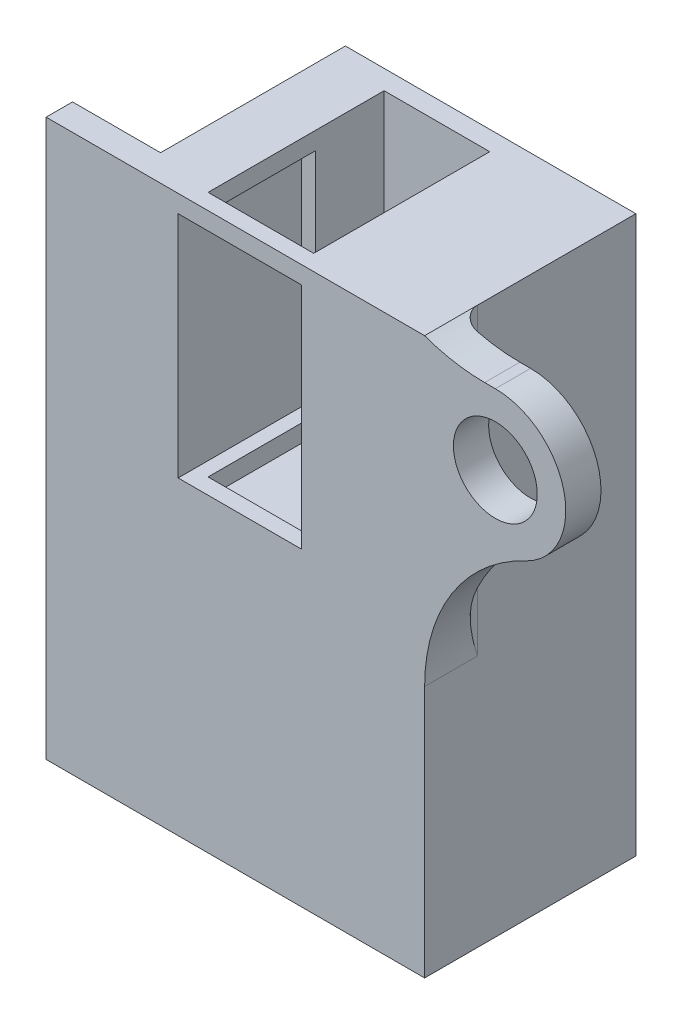
ISO-10303-21;
HEADER;
FILE_DESCRIPTION(('STEP AP214'),'2;1');
FILE_NAME('part.step','',(''),(''),'','','');
FILE_SCHEMA(('AUTOMOTIVE_DESIGN { 1 0 10303 214 1 1 1 1 }'));
ENDSEC;
DATA;
#1=APPLICATION_CONTEXT('core data for automotive mechanical design processes');
#2=APPLICATION_PROTOCOL_DEFINITION('international standard','automotive_design',2000,#1);
#3=PRODUCT_CONTEXT('',#1,'mechanical');
#4=PRODUCT('Part','Part','',(#3));
#5=PRODUCT_RELATED_PRODUCT_CATEGORY('part','',(#4));
#6=PRODUCT_DEFINITION_FORMATION('','',#4);
#7=PRODUCT_DEFINITION_CONTEXT('part definition',#1,'design');
#8=PRODUCT_DEFINITION('design','',#6,#7);
#9=PRODUCT_DEFINITION_SHAPE('','',#8);
#10=(LENGTH_UNIT() NAMED_UNIT(*) SI_UNIT(.MILLI.,.METRE.));
#11=(NAMED_UNIT(*) PLANE_ANGLE_UNIT() SI_UNIT($,.RADIAN.));
#12=(NAMED_UNIT(*) SI_UNIT($,.STERADIAN.) SOLID_ANGLE_UNIT());
#13=UNCERTAINTY_MEASURE_WITH_UNIT(LENGTH_MEASURE(1.E-05),#10,'distance_accuracy_value','');
#14=(GEOMETRIC_REPRESENTATION_CONTEXT(3) GLOBAL_UNCERTAINTY_ASSIGNED_CONTEXT((#13)) GLOBAL_UNIT_ASSIGNED_CONTEXT((#10,
#11,#12)) REPRESENTATION_CONTEXT('',''));
#15=CARTESIAN_POINT('',(0.,0.,0.));
#16=DIRECTION('',(0.,0.,1.));
#17=DIRECTION('',(1.,0.,0.));
#18=AXIS2_PLACEMENT_3D('',#15,#16,#17);
#19=CARTESIAN_POINT('',(0.,0.,-7.));
#20=DIRECTION('',(0.,0.,1.));
#21=DIRECTION('',(1.,0.,0.));
#22=AXIS2_PLACEMENT_3D('',#19,#20,#21);
#23=PLANE('',#22);
#24=DIRECTION('',(0.,-1.,0.));
#25=VECTOR('',#24,1.);
#26=CARTESIAN_POINT('',(3.3,0.,-7.));
#27=LINE('',#26,#25);
#28=CARTESIAN_POINT('',(3.3,32.6,-7.));
#29=VERTEX_POINT('',#28);
#30=CARTESIAN_POINT('',(3.3,19.6,-7.));
#31=VERTEX_POINT('',#30);
#32=EDGE_CURVE('E279',#29,#31,#27,.T.);
#33=ORIENTED_EDGE('',*,*,#32,.F.);
#34=DIRECTION('',(-1.,0.,0.));
#35=VECTOR('',#34,1.);
#36=CARTESIAN_POINT('',(0.,32.6,-7.));
#37=LINE('',#36,#35);
#38=CARTESIAN_POINT('',(2.5,32.6,-7.));
#39=VERTEX_POINT('',#38);
#40=EDGE_CURVE('E345',#29,#39,#37,.T.);
#41=ORIENTED_EDGE('',*,*,#40,.T.);
#42=DIRECTION('',(0.,-1.,0.));
#43=VECTOR('',#42,1.);
#44=CARTESIAN_POINT('',(2.50000000000001,0.,-7.));
#45=LINE('',#44,#43);
#46=CARTESIAN_POINT('',(2.5,19.6,-7.));
#47=VERTEX_POINT('',#46);
#48=EDGE_CURVE('E351',#39,#47,#45,.T.);
#49=ORIENTED_EDGE('',*,*,#48,.T.);
#50=DIRECTION('',(1.,0.,0.));
#51=VECTOR('',#50,1.);
#52=CARTESIAN_POINT('',(0.,19.6,-7.));
#53=LINE('',#52,#51);
#54=EDGE_CURVE('E356',#47,#31,#53,.T.);
#55=ORIENTED_EDGE('',*,*,#54,.T.);
#56=EDGE_LOOP('',(#33,#41,#49,#55));
#57=FACE_BOUND('',#56,.T.);
#58=ADVANCED_FACE('F43',(#57),#23,.T.);
#59=CARTESIAN_POINT('',(0.,0.,0.));
#60=DIRECTION('',(1.,0.,0.));
#61=DIRECTION('',(0.,0.,-1.));
#62=AXIS2_PLACEMENT_3D('',#59,#60,#61);
#63=PLANE('',#62);
#64=DIRECTION('',(0.,0.,1.));
#65=VECTOR('',#64,1.);
#66=CARTESIAN_POINT('',(0.,33.6,-12.));
#67=LINE('',#66,#65);
#68=CARTESIAN_POINT('',(0.,33.6,-12.));
#69=VERTEX_POINT('',#68);
#70=CARTESIAN_POINT('',(0.,33.6,-1.5));
#71=VERTEX_POINT('',#70);
#72=EDGE_CURVE('E304',#69,#71,#67,.T.);
#73=ORIENTED_EDGE('',*,*,#72,.F.);
#74=DIRECTION('',(0.,1.,0.));
#75=VECTOR('',#74,1.);
#76=CARTESIAN_POINT('',(0.,2.,-12.));
#77=LINE('',#76,#75);
#78=CARTESIAN_POINT('',(0.,2.,-12.));
#79=VERTEX_POINT('',#78);
#80=EDGE_CURVE('E288',#79,#69,#77,.T.);
#81=ORIENTED_EDGE('',*,*,#80,.F.);
#82=DIRECTION('',(0.,0.,1.));
#83=VECTOR('',#82,1.);
#84=CARTESIAN_POINT('',(0.,2.,-12.));
#85=LINE('',#84,#83);
#86=CARTESIAN_POINT('',(0.,2.,-1.5));
#87=VERTEX_POINT('',#86);
#88=EDGE_CURVE('E422',#79,#87,#85,.T.);
#89=ORIENTED_EDGE('',*,*,#88,.T.);
#90=DIRECTION('',(0.,-1.,0.));
#91=VECTOR('',#90,1.);
#92=CARTESIAN_POINT('',(0.,37.1,-1.5));
#93=LINE('',#92,#91);
#94=EDGE_CURVE('E321',#71,#87,#93,.T.);
#95=ORIENTED_EDGE('',*,*,#94,.F.);
#96=EDGE_LOOP('',(#73,#81,#89,#95));
#97=FACE_BOUND('',#96,.T.);
#98=ADVANCED_FACE('F492',(#97),#63,.F.);
#99=CARTESIAN_POINT('',(16.5,0.,0.));
#100=DIRECTION('',(0.,0.,-1.));
#101=DIRECTION('',(-1.,0.,0.));
#102=AXIS2_PLACEMENT_3D('',#99,#100,#101);
#103=PLANE('',#102);
#104=DIRECTION('',(-1.,0.,0.));
#105=VECTOR('',#104,1.);
#106=CARTESIAN_POINT('',(0.,32.6,0.));
#107=LINE('',#106,#105);
#108=CARTESIAN_POINT('',(9.5,32.6,0.));
#109=VERTEX_POINT('',#108);
#110=CARTESIAN_POINT('',(2.5,32.6,0.));
#111=VERTEX_POINT('',#110);
#112=EDGE_CURVE('E363',#109,#111,#107,.T.);
#113=ORIENTED_EDGE('',*,*,#112,.F.);
#114=DIRECTION('',(0.,1.,0.));
#115=VECTOR('',#114,1.);
#116=CARTESIAN_POINT('',(9.5,0.,0.));
#117=LINE('',#116,#115);
#118=CARTESIAN_POINT('',(9.5,19.6,0.));
#119=VERTEX_POINT('',#118);
#120=EDGE_CURVE('E340',#119,#109,#117,.T.);
#121=ORIENTED_EDGE('',*,*,#120,.F.);
#122=DIRECTION('',(1.,0.,0.));
#123=VECTOR('',#122,1.);
#124=CARTESIAN_POINT('',(0.,19.6,0.));
#125=LINE('',#124,#123);
#126=CARTESIAN_POINT('',(2.5,19.6,0.));
#127=VERTEX_POINT('',#126);
#128=EDGE_CURVE('E346',#127,#119,#125,.T.);
#129=ORIENTED_EDGE('',*,*,#128,.F.);
#130=DIRECTION('',(0.,-1.,0.));
#131=VECTOR('',#130,1.);
#132=CARTESIAN_POINT('',(2.50000000000001,0.,0.));
#133=LINE('',#132,#131);
#134=EDGE_CURVE('E367',#111,#127,#133,.T.);
#135=ORIENTED_EDGE('',*,*,#134,.F.);
#136=EDGE_LOOP('',(#113,#121,#129,#135));
#137=FACE_BOUND('',#136,.T.);
#138=CARTESIAN_POINT('',(20.5182193377738,29.,0.));
#139=DIRECTION('',(0.,0.,-1.));
#140=DIRECTION('',(-1.,0.,0.));
#141=AXIS2_PLACEMENT_3D('',#138,#139,#140);
#142=CIRCLE('',#141,2.38125);
#143=CARTESIAN_POINT('',(18.1369693377738,29.,0.));
#144=VERTEX_POINT('',#143);
#145=EDGE_CURVE('E398',#144,#144,#142,.T.);
#146=ORIENTED_EDGE('',*,*,#145,.T.);
#147=EDGE_LOOP('',(#146));
#148=FACE_BOUND('',#147,.T.);
#149=DIRECTION('',(-1.,0.,0.));
#150=VECTOR('',#149,1.);
#151=CARTESIAN_POINT('',(0.,33.,0.));
#152=LINE('',#151,#150);
#153=CARTESIAN_POINT('',(20.5182193377738,33.,0.));
#154=VERTEX_POINT('',#153);
#155=CARTESIAN_POINT('',(19.9117444218464,33.,0.));
#156=VERTEX_POINT('',#155);
#157=EDGE_CURVE('E408',#154,#156,#152,.T.);
#158=ORIENTED_EDGE('',*,*,#157,.T.);
#159=CARTESIAN_POINT('',(19.9117444218464,43.,0.));
#160=DIRECTION('',(0.,0.,-1.));
#161=DIRECTION('',(-1.,0.,0.));
#162=AXIS2_PLACEMENT_3D('',#159,#160,#161);
#163=CIRCLE('',#162,10.);
#164=CARTESIAN_POINT('',(16.5,33.6,0.));
#165=VERTEX_POINT('',#164);
#166=EDGE_CURVE('E439',#156,#165,#163,.T.);
#167=ORIENTED_EDGE('',*,*,#166,.T.);
#168=DIRECTION('',(1.,0.,0.));
#169=VECTOR('',#168,1.);
#170=CARTESIAN_POINT('',(-5.,33.6,0.));
#171=LINE('',#170,#169);
#172=CARTESIAN_POINT('',(-5.,33.6,0.));
#173=VERTEX_POINT('',#172);
#174=EDGE_CURVE('E313',#173,#165,#171,.T.);
#175=ORIENTED_EDGE('',*,*,#174,.F.);
#176=DIRECTION('',(0.,1.,0.));
#177=VECTOR('',#176,1.);
#178=CARTESIAN_POINT('',(-5.,2.,0.));
#179=LINE('',#178,#177);
#180=CARTESIAN_POINT('',(-5.,2.,0.));
#181=VERTEX_POINT('',#180);
#182=EDGE_CURVE('E322',#181,#173,#179,.T.);
#183=ORIENTED_EDGE('',*,*,#182,.F.);
#184=DIRECTION('',(1.,0.,0.));
#185=VECTOR('',#184,1.);
#186=CARTESIAN_POINT('',(0.,2.,0.));
#187=LINE('',#186,#185);
#188=CARTESIAN_POINT('',(16.5,2.,0.));
#189=VERTEX_POINT('',#188);
#190=EDGE_CURVE('E425',#181,#189,#187,.T.);
#191=ORIENTED_EDGE('',*,*,#190,.T.);
#192=DIRECTION('',(0.,-1.,0.));
#193=VECTOR('',#192,1.);
#194=CARTESIAN_POINT('',(16.5,0.,0.));
#195=LINE('',#194,#193);
#196=CARTESIAN_POINT('',(16.5,16.342263231169,0.));
#197=VERTEX_POINT('',#196);
#198=EDGE_CURVE('E431',#197,#189,#195,.T.);
#199=ORIENTED_EDGE('',*,*,#198,.F.);
#200=CARTESIAN_POINT('',(26.5,16.342263231169,0.));
#201=DIRECTION('',(0.,0.,-1.));
#202=DIRECTION('',(-1.,0.,0.));
#203=AXIS2_PLACEMENT_3D('',#200,#201,#202);
#204=CIRCLE('',#203,10.);
#205=CARTESIAN_POINT('',(22.2272995269813,25.383503780334,0.));
#206=VERTEX_POINT('',#205);
#207=EDGE_CURVE('E452',#197,#206,#204,.T.);
#208=ORIENTED_EDGE('',*,*,#207,.T.);
#209=CARTESIAN_POINT('',(20.5182193377738,29.,0.));
#210=DIRECTION('',(0.,0.,1.));
#211=DIRECTION('',(1.,0.,0.));
#212=AXIS2_PLACEMENT_3D('',#209,#210,#211);
#213=CIRCLE('',#212,4.);
#214=EDGE_CURVE('E402',#154,#206,#213,.F.);
#215=ORIENTED_EDGE('',*,*,#214,.F.);
#216=EDGE_LOOP('',(#158,#167,#175,#183,#191,#199,#208,#215));
#217=FACE_BOUND('',#216,.T.);
#218=ADVANCED_FACE('F480',(#137,#148,#217),#103,.F.);
#219=CARTESIAN_POINT('',(16.5,0.,0.));
#220=DIRECTION('',(1.,0.,0.));
#221=DIRECTION('',(0.,0.,-1.));
#222=AXIS2_PLACEMENT_3D('',#219,#220,#221);
#223=PLANE('',#222);
#224=DIRECTION('',(0.,0.,1.));
#225=VECTOR('',#224,1.);
#226=CARTESIAN_POINT('',(16.5,2.,-12.));
#227=LINE('',#226,#225);
#228=CARTESIAN_POINT('',(16.5,2.,-12.));
#229=VERTEX_POINT('',#228);
#230=EDGE_CURVE('E421',#229,#189,#227,.T.);
#231=ORIENTED_EDGE('',*,*,#230,.F.);
#232=DIRECTION('',(0.,-1.,0.));
#233=VECTOR('',#232,1.);
#234=CARTESIAN_POINT('',(16.5,2.,-12.));
#235=LINE('',#234,#233);
#236=CARTESIAN_POINT('',(16.5,33.6,-12.));
#237=VERTEX_POINT('',#236);
#238=EDGE_CURVE('E296',#237,#229,#235,.T.);
#239=ORIENTED_EDGE('',*,*,#238,.F.);
#240=DIRECTION('',(0.,0.,-1.));
#241=VECTOR('',#240,1.);
#242=CARTESIAN_POINT('',(16.5,33.6,0.));
#243=LINE('',#242,#241);
#244=CARTESIAN_POINT('',(16.5,33.6,-3.));
#245=VERTEX_POINT('',#244);
#246=EDGE_CURVE('E317',#245,#237,#243,.T.);
#247=ORIENTED_EDGE('',*,*,#246,.F.);
#248=DIRECTION('',(0.,1.,0.));
#249=VECTOR('',#248,1.);
#250=CARTESIAN_POINT('',(16.5,0.,-3.));
#251=LINE('',#250,#249);
#252=CARTESIAN_POINT('',(16.5,16.342263231169,-3.));
#253=VERTEX_POINT('',#252);
#254=EDGE_CURVE('E463',#245,#253,#251,.F.);
#255=ORIENTED_EDGE('',*,*,#254,.T.);
#256=DIRECTION('',(0.,0.,1.));
#257=VECTOR('',#256,1.);
#258=CARTESIAN_POINT('',(16.5,16.342263231169,0.));
#259=LINE('',#258,#257);
#260=EDGE_CURVE('E445',#253,#197,#259,.T.);
#261=ORIENTED_EDGE('',*,*,#260,.T.);
#262=ORIENTED_EDGE('',*,*,#198,.T.);
#263=EDGE_LOOP('',(#231,#239,#247,#255,#261,#262));
#264=FACE_BOUND('',#263,.T.);
#265=ADVANCED_FACE('F588',(#264),#223,.T.);
#266=CARTESIAN_POINT('',(0.,2.,-12.));
#267=DIRECTION('',(0.,1.,0.));
#268=DIRECTION('',(0.,0.,1.));
#269=AXIS2_PLACEMENT_3D('',#266,#267,#268);
#270=PLANE('',#269);
#271=CARTESIAN_POINT('',(8.25,2.,-6.));
#272=DIRECTION('',(0.,-1.,0.));
#273=DIRECTION('',(0.,0.,-1.));
#274=AXIS2_PLACEMENT_3D('',#271,#272,#273);
#275=CIRCLE('',#274,2.38125);
#276=CARTESIAN_POINT('',(8.25,2.,-8.38125));
#277=VERTEX_POINT('',#276);
#278=EDGE_CURVE('E377',#277,#277,#275,.T.);
#279=ORIENTED_EDGE('',*,*,#278,.F.);
#280=EDGE_LOOP('',(#279));
#281=FACE_BOUND('',#280,.T.);
#282=ORIENTED_EDGE('',*,*,#88,.F.);
#283=DIRECTION('',(-1.,0.,0.));
#284=VECTOR('',#283,1.);
#285=CARTESIAN_POINT('',(0.,2.,-12.));
#286=LINE('',#285,#284);
#287=EDGE_CURVE('E300',#229,#79,#286,.T.);
#288=ORIENTED_EDGE('',*,*,#287,.F.);
#289=ORIENTED_EDGE('',*,*,#230,.T.);
#290=ORIENTED_EDGE('',*,*,#190,.F.);
#291=DIRECTION('',(0.,0.,1.));
#292=VECTOR('',#291,1.);
#293=CARTESIAN_POINT('',(-5.,2.,-1.5));
#294=LINE('',#293,#292);
#295=CARTESIAN_POINT('',(-5.,2.,-1.5));
#296=VERTEX_POINT('',#295);
#297=EDGE_CURVE('E329',#296,#181,#294,.T.);
#298=ORIENTED_EDGE('',*,*,#297,.F.);
#299=DIRECTION('',(1.,0.,0.));
#300=VECTOR('',#299,1.);
#301=CARTESIAN_POINT('',(-5.,2.,-1.5));
#302=LINE('',#301,#300);
#303=EDGE_CURVE('E333',#296,#87,#302,.T.);
#304=ORIENTED_EDGE('',*,*,#303,.T.);
#305=EDGE_LOOP('',(#282,#288,#289,#290,#298,#304));
#306=FACE_BOUND('',#305,.T.);
#307=ADVANCED_FACE('F577',(#281,#306),#270,.F.);
#308=CARTESIAN_POINT('',(20.5182193377738,29.,-2.));
#309=DIRECTION('',(0.,0.,1.));
#310=DIRECTION('',(1.,0.,0.));
#311=AXIS2_PLACEMENT_3D('',#308,#309,#310);
#312=CYLINDRICAL_SURFACE('',#311,4.);
#313=ORIENTED_EDGE('',*,*,#214,.T.);
#314=DIRECTION('',(0.,0.,1.));
#315=VECTOR('',#314,1.);
#316=CARTESIAN_POINT('',(22.2272995269813,25.383503780334,-2.));
#317=LINE('',#316,#315);
#318=CARTESIAN_POINT('',(22.2272995269813,25.383503780334,-2.));
#319=VERTEX_POINT('',#318);
#320=EDGE_CURVE('E449',#206,#319,#317,.F.);
#321=ORIENTED_EDGE('',*,*,#320,.T.);
#322=CARTESIAN_POINT('',(20.5182193377738,29.,-2.));
#323=DIRECTION('',(0.,0.,1.));
#324=DIRECTION('',(1.,0.,0.));
#325=AXIS2_PLACEMENT_3D('',#322,#323,#324);
#326=CIRCLE('',#325,4.);
#327=CARTESIAN_POINT('',(20.5182193377738,33.,-2.));
#328=VERTEX_POINT('',#327);
#329=EDGE_CURVE('E403',#328,#319,#326,.F.);
#330=ORIENTED_EDGE('',*,*,#329,.F.);
#331=DIRECTION('',(0.,0.,1.));
#332=VECTOR('',#331,1.);
#333=CARTESIAN_POINT('',(20.5182193377738,33.,-2.));
#334=LINE('',#333,#332);
#335=EDGE_CURVE('E412',#328,#154,#334,.T.);
#336=ORIENTED_EDGE('',*,*,#335,.T.);
#337=EDGE_LOOP('',(#313,#321,#330,#336));
#338=FACE_BOUND('',#337,.T.);
#339=ADVANCED_FACE('F597',(#338),#312,.T.);
#340=CARTESIAN_POINT('',(0.,33.,-2.));
#341=DIRECTION('',(0.,1.,0.));
#342=DIRECTION('',(0.,0.,1.));
#343=AXIS2_PLACEMENT_3D('',#340,#341,#342);
#344=PLANE('',#343);
#345=DIRECTION('',(-1.,0.,0.));
#346=VECTOR('',#345,1.);
#347=CARTESIAN_POINT('',(0.,33.,-2.));
#348=LINE('',#347,#346);
#349=CARTESIAN_POINT('',(19.9117444218464,33.,-2.));
#350=VERTEX_POINT('',#349);
#351=EDGE_CURVE('E407',#328,#350,#348,.T.);
#352=ORIENTED_EDGE('',*,*,#351,.T.);
#353=DIRECTION('',(0.,0.,1.));
#354=VECTOR('',#353,1.);
#355=CARTESIAN_POINT('',(19.9117444218464,33.,0.));
#356=LINE('',#355,#354);
#357=EDGE_CURVE('E435',#350,#156,#356,.T.);
#358=ORIENTED_EDGE('',*,*,#357,.T.);
#359=ORIENTED_EDGE('',*,*,#157,.F.);
#360=ORIENTED_EDGE('',*,*,#335,.F.);
#361=EDGE_LOOP('',(#352,#358,#359,#360));
#362=FACE_BOUND('',#361,.T.);
#363=ADVANCED_FACE('F603',(#362),#344,.T.);
#364=CARTESIAN_POINT('',(0.,0.,-2.));
#365=DIRECTION('',(0.,0.,1.));
#366=DIRECTION('',(1.,0.,0.));
#367=AXIS2_PLACEMENT_3D('',#364,#365,#366);
#368=PLANE('',#367);
#369=CARTESIAN_POINT('',(20.5182193377738,29.,-2.));
#370=DIRECTION('',(0.,0.,-1.));
#371=DIRECTION('',(-1.,0.,0.));
#372=AXIS2_PLACEMENT_3D('',#369,#370,#371);
#373=CIRCLE('',#372,2.38125);
#374=CARTESIAN_POINT('',(18.1369693377738,29.,-2.));
#375=VERTEX_POINT('',#374);
#376=EDGE_CURVE('E391',#375,#375,#373,.T.);
#377=ORIENTED_EDGE('',*,*,#376,.F.);
#378=EDGE_LOOP('',(#377));
#379=FACE_BOUND('',#378,.T.);
#380=CARTESIAN_POINT('',(26.5,16.342263231169,-2.));
#381=DIRECTION('',(0.,0.,1.));
#382=DIRECTION('',(1.,0.,0.));
#383=AXIS2_PLACEMENT_3D('',#380,#381,#382);
#384=CIRCLE('',#383,10.);
#385=CARTESIAN_POINT('',(17.5,20.7011621747097,-2.));
#386=VERTEX_POINT('',#385);
#387=EDGE_CURVE('E455',#319,#386,#384,.T.);
#388=ORIENTED_EDGE('',*,*,#387,.T.);
#389=DIRECTION('',(0.,1.,0.));
#390=VECTOR('',#389,1.);
#391=CARTESIAN_POINT('',(17.5,0.,-2.));
#392=LINE('',#391,#390);
#393=CARTESIAN_POINT('',(17.5,33.2951821839,-2.));
#394=VERTEX_POINT('',#393);
#395=EDGE_CURVE('E459',#386,#394,#392,.T.);
#396=ORIENTED_EDGE('',*,*,#395,.T.);
#397=CARTESIAN_POINT('',(19.9117444218464,43.,-2.));
#398=DIRECTION('',(0.,0.,1.));
#399=DIRECTION('',(1.,0.,0.));
#400=AXIS2_PLACEMENT_3D('',#397,#398,#399);
#401=CIRCLE('',#400,10.);
#402=EDGE_CURVE('E442',#394,#350,#401,.T.);
#403=ORIENTED_EDGE('',*,*,#402,.T.);
#404=ORIENTED_EDGE('',*,*,#351,.F.);
#405=ORIENTED_EDGE('',*,*,#329,.T.);
#406=EDGE_LOOP('',(#388,#396,#403,#404,#405));
#407=FACE_BOUND('',#406,.T.);
#408=ADVANCED_FACE('F600',(#379,#407),#368,.F.);
#409=CARTESIAN_POINT('',(20.5182193377738,29.,10.6066017177982));
#410=DIRECTION('',(0.,0.,-1.));
#411=DIRECTION('',(-1.,0.,0.));
#412=AXIS2_PLACEMENT_3D('',#409,#410,#411);
#413=CYLINDRICAL_SURFACE('',#412,2.38125);
#414=ORIENTED_EDGE('',*,*,#376,.T.);
#415=EDGE_LOOP('',(#414));
#416=FACE_BOUND('',#415,.T.);
#417=ORIENTED_EDGE('',*,*,#145,.F.);
#418=EDGE_LOOP('',(#417));
#419=FACE_BOUND('',#418,.T.);
#420=ADVANCED_FACE('F610',(#416,#419),#413,.F.);
#421=CARTESIAN_POINT('',(8.25,8.35,-6.));
#422=DIRECTION('',(0.,-1.,0.));
#423=DIRECTION('',(0.,0.,-1.));
#424=AXIS2_PLACEMENT_3D('',#421,#422,#423);
#425=CYLINDRICAL_SURFACE('',#424,2.38125);
#426=CARTESIAN_POINT('',(8.25,8.35,-6.));
#427=DIRECTION('',(0.,-1.,0.));
#428=DIRECTION('',(0.,0.,-1.));
#429=AXIS2_PLACEMENT_3D('',#426,#427,#428);
#430=CIRCLE('',#429,2.38125);
#431=CARTESIAN_POINT('',(8.25,8.35,-8.38125));
#432=VERTEX_POINT('',#431);
#433=EDGE_CURVE('E387',#432,#432,#430,.T.);
#434=ORIENTED_EDGE('',*,*,#433,.F.);
#435=EDGE_LOOP('',(#434));
#436=FACE_BOUND('',#435,.T.);
#437=ORIENTED_EDGE('',*,*,#278,.T.);
#438=EDGE_LOOP('',(#437));
#439=FACE_BOUND('',#438,.T.);
#440=ADVANCED_FACE('F633',(#436,#439),#425,.F.);
#441=CARTESIAN_POINT('',(0.,8.35,0.));
#442=DIRECTION('',(0.,-1.,0.));
#443=DIRECTION('',(0.,0.,-1.));
#444=AXIS2_PLACEMENT_3D('',#441,#442,#443);
#445=PLANE('',#444);
#446=ORIENTED_EDGE('',*,*,#433,.T.);
#447=EDGE_LOOP('',(#446));
#448=FACE_BOUND('',#447,.T.);
#449=ADVANCED_FACE('F638',(#448),#445,.T.);
#450=CARTESIAN_POINT('',(9.5,0.,-7.));
#451=DIRECTION('',(1.,0.,0.));
#452=DIRECTION('',(0.,0.,-1.));
#453=AXIS2_PLACEMENT_3D('',#450,#451,#452);
#454=PLANE('',#453);
#455=ORIENTED_EDGE('',*,*,#120,.T.);
#456=DIRECTION('',(0.,0.,1.));
#457=VECTOR('',#456,1.);
#458=CARTESIAN_POINT('',(9.5,32.6,-7.));
#459=LINE('',#458,#457);
#460=CARTESIAN_POINT('',(9.5,32.6,-7.));
#461=VERTEX_POINT('',#460);
#462=EDGE_CURVE('E360',#461,#109,#459,.T.);
#463=ORIENTED_EDGE('',*,*,#462,.F.);
#464=DIRECTION('',(0.,1.,0.));
#465=VECTOR('',#464,1.);
#466=CARTESIAN_POINT('',(9.5,0.,-7.));
#467=LINE('',#466,#465);
#468=CARTESIAN_POINT('',(9.5,19.6,-7.));
#469=VERTEX_POINT('',#468);
#470=EDGE_CURVE('E341',#469,#461,#467,.T.);
#471=ORIENTED_EDGE('',*,*,#470,.F.);
#472=DIRECTION('',(0.,0.,1.));
#473=VECTOR('',#472,1.);
#474=CARTESIAN_POINT('',(9.5,19.6,-7.));
#475=LINE('',#474,#473);
#476=EDGE_CURVE('E374',#469,#119,#475,.T.);
#477=ORIENTED_EDGE('',*,*,#476,.T.);
#478=EDGE_LOOP('',(#455,#463,#471,#477));
#479=FACE_BOUND('',#478,.T.);
#480=ADVANCED_FACE('F644',(#479),#454,.F.);
#481=CARTESIAN_POINT('',(0.,19.6,-7.));
#482=DIRECTION('',(0.,-1.,0.));
#483=DIRECTION('',(0.,0.,-1.));
#484=AXIS2_PLACEMENT_3D('',#481,#482,#483);
#485=PLANE('',#484);
#486=DIRECTION('',(-1.,0.,0.));
#487=VECTOR('',#486,1.);
#488=CARTESIAN_POINT('',(0.,19.6,-0.9));
#489=LINE('',#488,#487);
#490=CARTESIAN_POINT('',(9.3,19.6,-0.9));
#491=VERTEX_POINT('',#490);
#492=CARTESIAN_POINT('',(3.3,19.6,-0.9));
#493=VERTEX_POINT('',#492);
#494=EDGE_CURVE('E267',#491,#493,#489,.T.);
#495=ORIENTED_EDGE('',*,*,#494,.T.);
#496=DIRECTION('',(0.,0.,-1.));
#497=VECTOR('',#496,1.);
#498=CARTESIAN_POINT('',(3.3,19.6,-7.));
#499=LINE('',#498,#497);
#500=EDGE_CURVE('E214',#493,#31,#499,.T.);
#501=ORIENTED_EDGE('',*,*,#500,.T.);
#502=ORIENTED_EDGE('',*,*,#54,.F.);
#503=DIRECTION('',(0.,0.,1.));
#504=VECTOR('',#503,1.);
#505=CARTESIAN_POINT('',(2.5,19.6,-7.));
#506=LINE('',#505,#504);
#507=EDGE_CURVE('E378',#47,#127,#506,.T.);
#508=ORIENTED_EDGE('',*,*,#507,.T.);
#509=ORIENTED_EDGE('',*,*,#128,.T.);
#510=ORIENTED_EDGE('',*,*,#476,.F.);
#511=CARTESIAN_POINT('',(9.3,19.6,-7.));
#512=VERTEX_POINT('',#511);
#513=EDGE_CURVE('E355',#512,#469,#53,.T.);
#514=ORIENTED_EDGE('',*,*,#513,.F.);
#515=DIRECTION('',(0.,0.,1.));
#516=VECTOR('',#515,1.);
#517=CARTESIAN_POINT('',(9.3,19.6,-7.));
#518=LINE('',#517,#516);
#519=EDGE_CURVE('E64',#512,#491,#518,.T.);
#520=ORIENTED_EDGE('',*,*,#519,.T.);
#521=EDGE_LOOP('',(#495,#501,#502,#508,#509,#510,#514,#520));
#522=FACE_BOUND('',#521,.T.);
#523=ADVANCED_FACE('F523',(#522),#485,.F.);
#524=CARTESIAN_POINT('',(2.50000000000001,0.,-7.));
#525=DIRECTION('',(-1.,0.,0.));
#526=DIRECTION('',(0.,-1.,0.));
#527=AXIS2_PLACEMENT_3D('',#524,#525,#526);
#528=PLANE('',#527);
#529=ORIENTED_EDGE('',*,*,#134,.T.);
#530=ORIENTED_EDGE('',*,*,#507,.F.);
#531=ORIENTED_EDGE('',*,*,#48,.F.);
#532=DIRECTION('',(0.,0.,1.));
#533=VECTOR('',#532,1.);
#534=CARTESIAN_POINT('',(2.5,32.6,-7.));
#535=LINE('',#534,#533);
#536=EDGE_CURVE('E381',#39,#111,#535,.T.);
#537=ORIENTED_EDGE('',*,*,#536,.T.);
#538=EDGE_LOOP('',(#529,#530,#531,#537));
#539=FACE_BOUND('',#538,.T.);
#540=ADVANCED_FACE('F516',(#539),#528,.F.);
#541=CARTESIAN_POINT('',(0.,32.6,-7.));
#542=DIRECTION('',(0.,1.,0.));
#543=DIRECTION('',(0.,0.,1.));
#544=AXIS2_PLACEMENT_3D('',#541,#542,#543);
#545=PLANE('',#544);
#546=ORIENTED_EDGE('',*,*,#40,.F.);
#547=DIRECTION('',(0.,0.,1.));
#548=VECTOR('',#547,1.);
#549=CARTESIAN_POINT('',(3.3,32.6,-7.));
#550=LINE('',#549,#548);
#551=CARTESIAN_POINT('',(3.3,32.6,-0.9));
#552=VERTEX_POINT('',#551);
#553=EDGE_CURVE('E282',#29,#552,#550,.T.);
#554=ORIENTED_EDGE('',*,*,#553,.T.);
#555=DIRECTION('',(1.,0.,0.));
#556=VECTOR('',#555,1.);
#557=CARTESIAN_POINT('',(0.,32.6,-0.9));
#558=LINE('',#557,#556);
#559=CARTESIAN_POINT('',(9.3,32.6,-0.9));
#560=VERTEX_POINT('',#559);
#561=EDGE_CURVE('E258',#552,#560,#558,.T.);
#562=ORIENTED_EDGE('',*,*,#561,.T.);
#563=DIRECTION('',(0.,0.,-1.));
#564=VECTOR('',#563,1.);
#565=CARTESIAN_POINT('',(9.3,32.6,-7.));
#566=LINE('',#565,#564);
#567=CARTESIAN_POINT('',(9.3,32.6,-7.));
#568=VERTEX_POINT('',#567);
#569=EDGE_CURVE('E273',#560,#568,#566,.T.);
#570=ORIENTED_EDGE('',*,*,#569,.T.);
#571=EDGE_CURVE('E347',#461,#568,#37,.T.);
#572=ORIENTED_EDGE('',*,*,#571,.F.);
#573=ORIENTED_EDGE('',*,*,#462,.T.);
#574=ORIENTED_EDGE('',*,*,#112,.T.);
#575=ORIENTED_EDGE('',*,*,#536,.F.);
#576=EDGE_LOOP('',(#546,#554,#562,#570,#572,#573,#574,#575));
#577=FACE_BOUND('',#576,.T.);
#578=ADVANCED_FACE('F507',(#577),#545,.F.);
#579=DIRECTION('',(0.,1.,0.));
#580=VECTOR('',#579,1.);
#581=CARTESIAN_POINT('',(9.3,0.,-7.));
#582=LINE('',#581,#580);
#583=EDGE_CURVE('E270',#512,#568,#582,.T.);
#584=ORIENTED_EDGE('',*,*,#583,.F.);
#585=ORIENTED_EDGE('',*,*,#513,.T.);
#586=ORIENTED_EDGE('',*,*,#470,.T.);
#587=ORIENTED_EDGE('',*,*,#571,.T.);
#588=EDGE_LOOP('',(#584,#585,#586,#587));
#589=FACE_BOUND('',#588,.T.);
#590=ADVANCED_FACE('F495',(#589),#23,.T.);
#591=CARTESIAN_POINT('',(-5.,37.1,-1.5));
#592=DIRECTION('',(0.,0.,1.));
#593=DIRECTION('',(0.,-1.,0.));
#594=AXIS2_PLACEMENT_3D('',#591,#592,#593);
#595=PLANE('',#594);
#596=DIRECTION('',(0.,-1.,0.));
#597=VECTOR('',#596,1.);
#598=CARTESIAN_POINT('',(-5.,37.1,-1.5));
#599=LINE('',#598,#597);
#600=CARTESIAN_POINT('',(-5.,33.6,-1.5));
#601=VERTEX_POINT('',#600);
#602=EDGE_CURVE('E326',#601,#296,#599,.T.);
#603=ORIENTED_EDGE('',*,*,#602,.F.);
#604=DIRECTION('',(-1.,0.,0.));
#605=VECTOR('',#604,1.);
#606=CARTESIAN_POINT('',(0.,33.6,-1.5));
#607=LINE('',#606,#605);
#608=EDGE_CURVE('E307',#71,#601,#607,.T.);
#609=ORIENTED_EDGE('',*,*,#608,.F.);
#610=ORIENTED_EDGE('',*,*,#94,.T.);
#611=ORIENTED_EDGE('',*,*,#303,.F.);
#612=EDGE_LOOP('',(#603,#609,#610,#611));
#613=FACE_BOUND('',#612,.T.);
#614=ADVANCED_FACE('F506',(#613),#595,.F.);
#615=CARTESIAN_POINT('',(-5.,0.,0.));
#616=DIRECTION('',(-1.,0.,0.));
#617=DIRECTION('',(0.,0.,1.));
#618=AXIS2_PLACEMENT_3D('',#615,#616,#617);
#619=PLANE('',#618);
#620=DIRECTION('',(0.,0.,1.));
#621=VECTOR('',#620,1.);
#622=CARTESIAN_POINT('',(-5.,33.6,-1.5));
#623=LINE('',#622,#621);
#624=EDGE_CURVE('E310',#601,#173,#623,.T.);
#625=ORIENTED_EDGE('',*,*,#624,.F.);
#626=ORIENTED_EDGE('',*,*,#602,.T.);
#627=ORIENTED_EDGE('',*,*,#297,.T.);
#628=ORIENTED_EDGE('',*,*,#182,.T.);
#629=EDGE_LOOP('',(#625,#626,#627,#628));
#630=FACE_BOUND('',#629,.T.);
#631=ADVANCED_FACE('F514',(#630),#619,.T.);
#632=CARTESIAN_POINT('',(0.,33.6,0.));
#633=DIRECTION('',(0.,-1.,0.));
#634=DIRECTION('',(0.,0.,-1.));
#635=AXIS2_PLACEMENT_3D('',#632,#633,#634);
#636=PLANE('',#635);
#637=DIRECTION('',(1.,0.,0.));
#638=VECTOR('',#637,1.);
#639=CARTESIAN_POINT('',(3.3,33.6,-0.9));
#640=LINE('',#639,#638);
#641=CARTESIAN_POINT('',(3.3,33.6,-0.9));
#642=VERTEX_POINT('',#641);
#643=CARTESIAN_POINT('',(9.3,33.6,-0.9));
#644=VERTEX_POINT('',#643);
#645=EDGE_CURVE('E248',#642,#644,#640,.T.);
#646=ORIENTED_EDGE('',*,*,#645,.F.);
#647=DIRECTION('',(0.,0.,1.));
#648=VECTOR('',#647,1.);
#649=CARTESIAN_POINT('',(3.3,33.6,-10.9));
#650=LINE('',#649,#648);
#651=CARTESIAN_POINT('',(3.3,33.6,-10.9));
#652=VERTEX_POINT('',#651);
#653=EDGE_CURVE('E72',#652,#642,#650,.T.);
#654=ORIENTED_EDGE('',*,*,#653,.F.);
#655=DIRECTION('',(-1.,0.,0.));
#656=VECTOR('',#655,1.);
#657=CARTESIAN_POINT('',(3.3,33.6,-10.9));
#658=LINE('',#657,#656);
#659=CARTESIAN_POINT('',(9.3,33.6,-10.9));
#660=VERTEX_POINT('',#659);
#661=EDGE_CURVE('E235',#660,#652,#658,.T.);
#662=ORIENTED_EDGE('',*,*,#661,.F.);
#663=DIRECTION('',(0.,0.,-1.));
#664=VECTOR('',#663,1.);
#665=CARTESIAN_POINT('',(9.3,33.6,-10.9));
#666=LINE('',#665,#664);
#667=EDGE_CURVE('E239',#644,#660,#666,.T.);
#668=ORIENTED_EDGE('',*,*,#667,.F.);
#669=EDGE_LOOP('',(#646,#654,#662,#668));
#670=FACE_BOUND('',#669,.T.);
#671=ORIENTED_EDGE('',*,*,#246,.T.);
#672=DIRECTION('',(1.,0.,0.));
#673=VECTOR('',#672,1.);
#674=CARTESIAN_POINT('',(0.,33.6,-12.));
#675=LINE('',#674,#673);
#676=EDGE_CURVE('E292',#69,#237,#675,.T.);
#677=ORIENTED_EDGE('',*,*,#676,.F.);
#678=ORIENTED_EDGE('',*,*,#72,.T.);
#679=ORIENTED_EDGE('',*,*,#608,.T.);
#680=ORIENTED_EDGE('',*,*,#624,.T.);
#681=ORIENTED_EDGE('',*,*,#174,.T.);
#682=EDGE_CURVE('E318',#165,#245,#243,.T.);
#683=ORIENTED_EDGE('',*,*,#682,.T.);
#684=EDGE_LOOP('',(#671,#677,#678,#679,#680,#681,#683));
#685=FACE_BOUND('',#684,.T.);
#686=ADVANCED_FACE('F478',(#670,#685),#636,.F.);
#687=CARTESIAN_POINT('',(19.9117444218464,43.,0.));
#688=DIRECTION('',(0.,0.,-1.));
#689=DIRECTION('',(-1.,0.,0.));
#690=AXIS2_PLACEMENT_3D('',#687,#688,#689);
#691=CYLINDRICAL_SURFACE('',#690,10.);
#692=ORIENTED_EDGE('',*,*,#402,.F.);
#693=CARTESIAN_POINT('',(17.5,33.2951821839,-2.));
#694=CARTESIAN_POINT('',(17.4416882046076,33.3096521513916,-1.99996377159555));
#695=CARTESIAN_POINT('',(17.3835448570359,33.3246797672575,-2.00509729641203));
#696=CARTESIAN_POINT('',(17.2691894306341,33.3552970068834,-2.02528178802682));
#697=CARTESIAN_POINT('',(17.2129763122904,33.370886318572,-2.04032732575709));
#698=CARTESIAN_POINT('',(17.1039998442129,33.4020931624776,-2.07991778830303));
#699=CARTESIAN_POINT('',(17.0512370422384,33.417710698773,-2.10446421718611));
#700=CARTESIAN_POINT('',(16.9506212007074,33.4483242872222,-2.16241344629458));
#701=CARTESIAN_POINT('',(16.9027678199665,33.4633203825204,-2.19581563050275));
#702=CARTESIAN_POINT('',(16.8133948734528,33.4919804261872,-2.27063887890849));
#703=CARTESIAN_POINT('',(16.7718704395181,33.5056453954947,-2.31205372362896));
#704=CARTESIAN_POINT('',(16.6964431848553,33.5309227438538,-2.40189151600445));
#705=CARTESIAN_POINT('',(16.6625404522537,33.5425350991717,-2.45031454468144));
#706=CARTESIAN_POINT('',(16.6046947097274,33.5626100803941,-2.55092090933748));
#707=CARTESIAN_POINT('',(16.5804299370159,33.5711732462641,-2.60289915195508));
#708=CARTESIAN_POINT('',(16.5410873005675,33.5851653108669,-2.71058607085887));
#709=CARTESIAN_POINT('',(16.5259962909772,33.590598693939,-2.76628928157378));
#710=CARTESIAN_POINT('',(16.5105487685177,33.5961765065227,-2.85211540040821));
#711=CARTESIAN_POINT('',(16.5065958447039,33.5976080034534,-2.88155237267648));
#712=CARTESIAN_POINT('',(16.5013224671775,33.5995199180946,-2.94065406686891));
#713=CARTESIAN_POINT('',(16.4999986917682,33.600001535888,-2.97031845382046));
#714=CARTESIAN_POINT('',(16.5,33.6,-3.));
#715=B_SPLINE_CURVE_WITH_KNOTS('',3,(#693,#694,#695,#696,#697,#698,#699,#700,#701,#702,#703,
#704,#705,#706,#707,#708,#709,#710,#711,#712,#713,#714),.UNSPECIFIED.,.F.,.F.,(4,2,2,2,2,2,2,2,
2,2,4),(0.,0.179979391065258,0.359860284590325,0.539769666360691,0.719666536695732,
0.899424326151548,1.07918419396243,1.25230100574518,1.42516915555092,1.51425951775296,
1.60323725036706),.UNSPECIFIED.);
#716=EDGE_CURVE('E57',#394,#245,#715,.T.);
#717=ORIENTED_EDGE('',*,*,#716,.T.);
#718=ORIENTED_EDGE('',*,*,#682,.F.);
#719=ORIENTED_EDGE('',*,*,#166,.F.);
#720=ORIENTED_EDGE('',*,*,#357,.F.);
#721=EDGE_LOOP('',(#692,#717,#718,#719,#720));
#722=FACE_BOUND('',#721,.T.);
#723=ADVANCED_FACE('F473',(#722),#691,.F.);
#724=CARTESIAN_POINT('',(26.5,16.342263231169,-2.));
#725=DIRECTION('',(0.,0.,1.));
#726=DIRECTION('',(1.,0.,0.));
#727=AXIS2_PLACEMENT_3D('',#724,#725,#726);
#728=CYLINDRICAL_SURFACE('',#727,10.);
#729=ORIENTED_EDGE('',*,*,#387,.F.);
#730=ORIENTED_EDGE('',*,*,#320,.F.);
#731=ORIENTED_EDGE('',*,*,#207,.F.);
#732=ORIENTED_EDGE('',*,*,#260,.F.);
#733=CARTESIAN_POINT('',(17.5,20.7011621747097,-2.));
#734=CARTESIAN_POINT('',(17.4649705918882,20.6288396959497,-2.00001517907888));
#735=CARTESIAN_POINT('',(17.4308249738421,20.556111587016,-2.00183974990828));
#736=CARTESIAN_POINT('',(17.3643618176126,20.4100074789031,-2.00867500405915));
#737=CARTESIAN_POINT('',(17.3320435036572,20.336631770189,-2.01368432408378));
#738=CARTESIAN_POINT('',(17.2693266347427,20.1894773913306,-2.02644469931918));
#739=CARTESIAN_POINT('',(17.2389244580283,20.1156997864008,-2.03419038738089));
#740=CARTESIAN_POINT('',(17.1799867691033,19.9676874000717,-2.05208658188006));
#741=CARTESIAN_POINT('',(17.1514514850332,19.8934525640055,-2.06223738153228));
#742=CARTESIAN_POINT('',(17.0688926274996,19.6708057930277,-2.09574919733705));
#743=CARTESIAN_POINT('',(17.017647311377,19.5218199539269,-2.12222969644671));
#744=CARTESIAN_POINT('',(16.9225479634451,19.2227266295524,-2.18165298985507));
#745=CARTESIAN_POINT('',(16.8786986935253,19.0726184861419,-2.21459991820859));
#746=CARTESIAN_POINT('',(16.7820109335453,18.7105191846494,-2.29987772594522));
#747=CARTESIAN_POINT('',(16.732746945945,18.4981381547551,-2.35464870463528));
#748=CARTESIAN_POINT('',(16.6484261900647,18.0724702024824,-2.47087286474006));
#749=CARTESIAN_POINT('',(16.6133715529952,17.8591831490567,-2.53232704679311));
#750=CARTESIAN_POINT('',(16.5291314236184,17.2182827355187,-2.72300296786534));
#751=CARTESIAN_POINT('',(16.5008343674646,16.7894961375238,-2.85857288785149));
#752=CARTESIAN_POINT('',(16.5000060646769,16.3549759307317,-2.99597991124583));
#753=CARTESIAN_POINT('',(16.5000000044712,16.3486195087201,-2.99798998882368));
#754=CARTESIAN_POINT('',(16.5,16.342263231169,-3.));
#755=B_SPLINE_CURVE_WITH_KNOTS('',3,(#733,#734,#735,#736,#737,#738,#739,#740,#741,#742,#743,
#744,#745,#746,#747,#748,#749,#750,#751,#752,#753,#754),.UNSPECIFIED.,.F.,.F.,(4,2,2,2,2,2,2,2,
2,2,4),(0.,0.241022397911186,0.481941690674264,0.722391040963445,0.962869720289598,
1.44176483881817,1.92096712310371,2.59465687968437,3.26844764326604,4.61560355969885,
4.63560356796335),.UNSPECIFIED.);
#756=EDGE_CURVE('E11',#253,#386,#755,.F.);
#757=ORIENTED_EDGE('',*,*,#756,.T.);
#758=EDGE_LOOP('',(#729,#730,#731,#732,#757));
#759=FACE_BOUND('',#758,.T.);
#760=ADVANCED_FACE('F477',(#759),#728,.F.);
#761=CARTESIAN_POINT('',(17.5,0.,-3.));
#762=DIRECTION('',(0.,1.,0.));
#763=DIRECTION('',(0.,0.,1.));
#764=AXIS2_PLACEMENT_3D('',#761,#762,#763);
#765=CYLINDRICAL_SURFACE('',#764,1.);
#766=ORIENTED_EDGE('',*,*,#756,.F.);
#767=ORIENTED_EDGE('',*,*,#254,.F.);
#768=ORIENTED_EDGE('',*,*,#716,.F.);
#769=ORIENTED_EDGE('',*,*,#395,.F.);
#770=EDGE_LOOP('',(#766,#767,#768,#769));
#771=FACE_BOUND('',#770,.T.);
#772=ADVANCED_FACE('F45',(#771),#765,.F.);
#773=CARTESIAN_POINT('',(0.,0.,-12.));
#774=DIRECTION('',(0.,0.,-1.));
#775=DIRECTION('',(-1.,0.,0.));
#776=AXIS2_PLACEMENT_3D('',#773,#774,#775);
#777=PLANE('',#776);
#778=ORIENTED_EDGE('',*,*,#80,.T.);
#779=ORIENTED_EDGE('',*,*,#676,.T.);
#780=ORIENTED_EDGE('',*,*,#238,.T.);
#781=ORIENTED_EDGE('',*,*,#287,.T.);
#782=EDGE_LOOP('',(#778,#779,#780,#781));
#783=FACE_BOUND('',#782,.T.);
#784=ADVANCED_FACE('F488',(#783),#777,.T.);
#785=CARTESIAN_POINT('',(3.3,18.6,-10.9));
#786=DIRECTION('',(-1.,0.,0.));
#787=DIRECTION('',(0.,0.,1.));
#788=AXIS2_PLACEMENT_3D('',#785,#786,#787);
#789=PLANE('',#788);
#790=DIRECTION('',(0.,1.,0.));
#791=VECTOR('',#790,1.);
#792=CARTESIAN_POINT('',(3.3,18.6,-0.9));
#793=LINE('',#792,#791);
#794=CARTESIAN_POINT('',(3.3,18.6,-0.9));
#795=VERTEX_POINT('',#794);
#796=EDGE_CURVE('E207',#795,#493,#793,.T.);
#797=ORIENTED_EDGE('',*,*,#796,.F.);
#798=DIRECTION('',(0.,0.,1.));
#799=VECTOR('',#798,1.);
#800=CARTESIAN_POINT('',(3.3,18.6,-10.9));
#801=LINE('',#800,#799);
#802=CARTESIAN_POINT('',(3.3,18.6,-10.9));
#803=VERTEX_POINT('',#802);
#804=EDGE_CURVE('E211',#803,#795,#801,.T.);
#805=ORIENTED_EDGE('',*,*,#804,.F.);
#806=DIRECTION('',(0.,1.,0.));
#807=VECTOR('',#806,1.);
#808=CARTESIAN_POINT('',(3.3,18.6,-10.9));
#809=LINE('',#808,#807);
#810=EDGE_CURVE('E255',#803,#652,#809,.T.);
#811=ORIENTED_EDGE('',*,*,#810,.T.);
#812=ORIENTED_EDGE('',*,*,#653,.T.);
#813=EDGE_CURVE('E219',#552,#642,#793,.T.);
#814=ORIENTED_EDGE('',*,*,#813,.F.);
#815=ORIENTED_EDGE('',*,*,#553,.F.);
#816=ORIENTED_EDGE('',*,*,#32,.T.);
#817=ORIENTED_EDGE('',*,*,#500,.F.);
#818=EDGE_LOOP('',(#797,#805,#811,#812,#814,#815,#816,#817));
#819=FACE_BOUND('',#818,.T.);
#820=ADVANCED_FACE('F209',(#819),#789,.F.);
#821=CARTESIAN_POINT('',(9.3,18.6,-10.9));
#822=DIRECTION('',(1.,0.,0.));
#823=DIRECTION('',(0.,0.,-1.));
#824=AXIS2_PLACEMENT_3D('',#821,#822,#823);
#825=PLANE('',#824);
#826=ORIENTED_EDGE('',*,*,#583,.T.);
#827=ORIENTED_EDGE('',*,*,#569,.F.);
#828=DIRECTION('',(0.,1.,0.));
#829=VECTOR('',#828,1.);
#830=CARTESIAN_POINT('',(9.3,18.6,-0.9));
#831=LINE('',#830,#829);
#832=EDGE_CURVE('E218',#560,#644,#831,.T.);
#833=ORIENTED_EDGE('',*,*,#832,.T.);
#834=ORIENTED_EDGE('',*,*,#667,.T.);
#835=DIRECTION('',(0.,1.,0.));
#836=VECTOR('',#835,1.);
#837=CARTESIAN_POINT('',(9.3,18.6,-10.9));
#838=LINE('',#837,#836);
#839=CARTESIAN_POINT('',(9.3,18.6,-10.9));
#840=VERTEX_POINT('',#839);
#841=EDGE_CURVE('E259',#840,#660,#838,.T.);
#842=ORIENTED_EDGE('',*,*,#841,.F.);
#843=DIRECTION('',(0.,0.,-1.));
#844=VECTOR('',#843,1.);
#845=CARTESIAN_POINT('',(9.3,18.6,-10.9));
#846=LINE('',#845,#844);
#847=CARTESIAN_POINT('',(9.3,18.6,-0.9));
#848=VERTEX_POINT('',#847);
#849=EDGE_CURVE('E229',#848,#840,#846,.T.);
#850=ORIENTED_EDGE('',*,*,#849,.F.);
#851=EDGE_CURVE('E224',#848,#491,#831,.T.);
#852=ORIENTED_EDGE('',*,*,#851,.T.);
#853=ORIENTED_EDGE('',*,*,#519,.F.);
#854=EDGE_LOOP('',(#826,#827,#833,#834,#842,#850,#852,#853));
#855=FACE_BOUND('',#854,.T.);
#856=ADVANCED_FACE('F538',(#855),#825,.F.);
#857=CARTESIAN_POINT('',(3.3,18.6,-0.9));
#858=DIRECTION('',(0.,0.,1.));
#859=DIRECTION('',(1.,0.,0.));
#860=AXIS2_PLACEMENT_3D('',#857,#858,#859);
#861=PLANE('',#860);
#862=ORIENTED_EDGE('',*,*,#851,.F.);
#863=DIRECTION('',(1.,0.,0.));
#864=VECTOR('',#863,1.);
#865=CARTESIAN_POINT('',(3.3,18.6,-0.9));
#866=LINE('',#865,#864);
#867=EDGE_CURVE('E222',#795,#848,#866,.T.);
#868=ORIENTED_EDGE('',*,*,#867,.F.);
#869=ORIENTED_EDGE('',*,*,#796,.T.);
#870=ORIENTED_EDGE('',*,*,#494,.F.);
#871=EDGE_LOOP('',(#862,#868,#869,#870));
#872=FACE_BOUND('',#871,.T.);
#873=ADVANCED_FACE('F223',(#872),#861,.F.);
#874=ORIENTED_EDGE('',*,*,#813,.T.);
#875=ORIENTED_EDGE('',*,*,#645,.T.);
#876=ORIENTED_EDGE('',*,*,#832,.F.);
#877=ORIENTED_EDGE('',*,*,#561,.F.);
#878=EDGE_LOOP('',(#874,#875,#876,#877));
#879=FACE_BOUND('',#878,.T.);
#880=ADVANCED_FACE('F532',(#879),#861,.F.);
#881=CARTESIAN_POINT('',(3.3,18.6,-10.9));
#882=DIRECTION('',(0.,0.,-1.));
#883=DIRECTION('',(-1.,0.,0.));
#884=AXIS2_PLACEMENT_3D('',#881,#882,#883);
#885=PLANE('',#884);
#886=ORIENTED_EDGE('',*,*,#661,.T.);
#887=ORIENTED_EDGE('',*,*,#810,.F.);
#888=DIRECTION('',(-1.,0.,0.));
#889=VECTOR('',#888,1.);
#890=CARTESIAN_POINT('',(3.3,18.6,-10.9));
#891=LINE('',#890,#889);
#892=EDGE_CURVE('E233',#840,#803,#891,.T.);
#893=ORIENTED_EDGE('',*,*,#892,.F.);
#894=ORIENTED_EDGE('',*,*,#841,.T.);
#895=EDGE_LOOP('',(#886,#887,#893,#894));
#896=FACE_BOUND('',#895,.T.);
#897=ADVANCED_FACE('F544',(#896),#885,.F.);
#898=CARTESIAN_POINT('',(0.,18.6,0.));
#899=DIRECTION('',(0.,1.,0.));
#900=DIRECTION('',(0.,0.,1.));
#901=AXIS2_PLACEMENT_3D('',#898,#899,#900);
#902=PLANE('',#901);
#903=ORIENTED_EDGE('',*,*,#804,.T.);
#904=ORIENTED_EDGE('',*,*,#867,.T.);
#905=ORIENTED_EDGE('',*,*,#849,.T.);
#906=ORIENTED_EDGE('',*,*,#892,.T.);
#907=EDGE_LOOP('',(#903,#904,#905,#906));
#908=FACE_BOUND('',#907,.T.);
#909=ADVANCED_FACE('F231',(#908),#902,.T.);
#910=CLOSED_SHELL('',(#58,#98,#218,#265,#307,#339,#363,#408,#420,#440,#449,#480,#523,#540,#578,
#590,#614,#631,#686,#723,#760,#772,#784,#820,#856,#873,#880,#897,#909));
#911=MANIFOLD_SOLID_BREP('B2',#910);
#912=ADVANCED_BREP_SHAPE_REPRESENTATION('',(#18,#911),#14);
#913=SHAPE_DEFINITION_REPRESENTATION(#9,#912);
ENDSEC;
END-ISO-10303-21;
